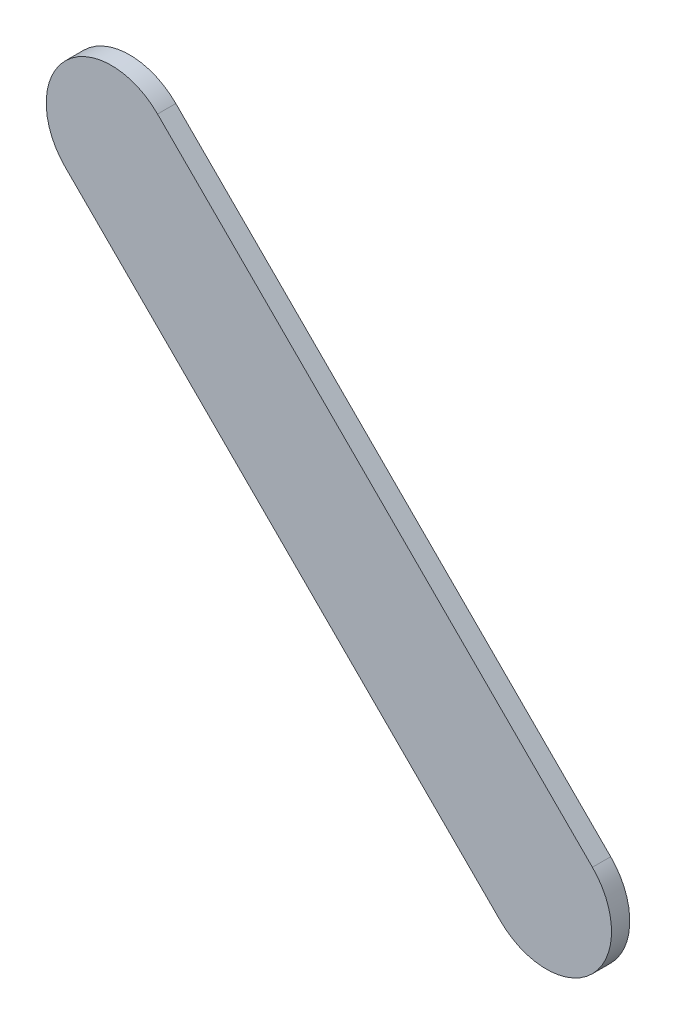
ISO-10303-21;
HEADER;
FILE_DESCRIPTION(('STEP AP214'),'2;1');
FILE_NAME('part.step','',(''),(''),'','','');
FILE_SCHEMA(('AUTOMOTIVE_DESIGN { 1 0 10303 214 1 1 1 1 }'));
ENDSEC;
DATA;
#1=APPLICATION_CONTEXT('core data for automotive mechanical design processes');
#2=APPLICATION_PROTOCOL_DEFINITION('international standard','automotive_design',2000,#1);
#3=PRODUCT_CONTEXT('',#1,'mechanical');
#4=PRODUCT('Part','Part','',(#3));
#5=PRODUCT_RELATED_PRODUCT_CATEGORY('part','',(#4));
#6=PRODUCT_DEFINITION_FORMATION('','',#4);
#7=PRODUCT_DEFINITION_CONTEXT('part definition',#1,'design');
#8=PRODUCT_DEFINITION('design','',#6,#7);
#9=PRODUCT_DEFINITION_SHAPE('','',#8);
#10=(LENGTH_UNIT() NAMED_UNIT(*) SI_UNIT(.MILLI.,.METRE.));
#11=(NAMED_UNIT(*) PLANE_ANGLE_UNIT() SI_UNIT($,.RADIAN.));
#12=(NAMED_UNIT(*) SI_UNIT($,.STERADIAN.) SOLID_ANGLE_UNIT());
#13=UNCERTAINTY_MEASURE_WITH_UNIT(LENGTH_MEASURE(1.E-05),#10,'distance_accuracy_value','');
#14=(GEOMETRIC_REPRESENTATION_CONTEXT(3) GLOBAL_UNCERTAINTY_ASSIGNED_CONTEXT((#13)) GLOBAL_UNIT_ASSIGNED_CONTEXT((#10,
#11,#12)) REPRESENTATION_CONTEXT('',''));
#15=CARTESIAN_POINT('',(0.,0.,0.));
#16=DIRECTION('',(0.,0.,1.));
#17=DIRECTION('',(1.,0.,0.));
#18=AXIS2_PLACEMENT_3D('',#15,#16,#17);
#19=CARTESIAN_POINT('',(86.580218,94.04412484,0.));
#20=DIRECTION('',(0.707106781186542,0.707106781186554,0.));
#21=DIRECTION('',(0.707106781186554,-0.707106781186542,0.));
#22=AXIS2_PLACEMENT_3D('',#19,#20,#21);
#23=PLANE('',#22);
#24=DIRECTION('',(0.707106781186554,-0.707106781186542,0.));
#25=VECTOR('',#24,1.);
#26=CARTESIAN_POINT('',(86.580218,94.04412484,0.03556));
#27=LINE('',#26,#25);
#28=CARTESIAN_POINT('',(86.580218,94.04412484,0.03556));
#29=VERTEX_POINT('',#28);
#30=CARTESIAN_POINT('',(87.42717084,93.197172,0.03556));
#31=VERTEX_POINT('',#30);
#32=EDGE_CURVE('E11',#29,#31,#27,.T.);
#33=ORIENTED_EDGE('',*,*,#32,.F.);
#34=DIRECTION('',(0.,0.,1.));
#35=VECTOR('',#34,1.);
#36=CARTESIAN_POINT('',(86.580218,94.04412484,0.));
#37=LINE('',#36,#35);
#38=CARTESIAN_POINT('',(86.580218,94.04412484,0.));
#39=VERTEX_POINT('',#38);
#40=EDGE_CURVE('E24',#39,#29,#37,.T.);
#41=ORIENTED_EDGE('',*,*,#40,.F.);
#42=DIRECTION('',(0.707106781186554,-0.707106781186542,0.));
#43=VECTOR('',#42,1.);
#44=CARTESIAN_POINT('',(86.580218,94.04412484,0.));
#45=LINE('',#44,#43);
#46=CARTESIAN_POINT('',(87.42717084,93.197172,0.));
#47=VERTEX_POINT('',#46);
#48=EDGE_CURVE('E75',#39,#47,#45,.T.);
#49=ORIENTED_EDGE('',*,*,#48,.T.);
#50=DIRECTION('',(0.,0.,1.));
#51=VECTOR('',#50,1.);
#52=CARTESIAN_POINT('',(87.42717084,93.197172,0.));
#53=LINE('',#52,#51);
#54=EDGE_CURVE('E37',#47,#31,#53,.T.);
#55=ORIENTED_EDGE('',*,*,#54,.T.);
#56=EDGE_LOOP('',(#33,#41,#49,#55));
#57=FACE_BOUND('',#56,.T.);
#58=ADVANCED_FACE('F17',(#57),#23,.F.);
#59=CARTESIAN_POINT('',(87.51697254,93.2869737,0.));
#60=DIRECTION('',(0.,0.,-1.));
#61=DIRECTION('',(-0.707106781186492,-0.707106781186604,0.));
#62=AXIS2_PLACEMENT_3D('',#59,#60,#61);
#63=CYLINDRICAL_SURFACE('',#62,0.12699878206416);
#64=CARTESIAN_POINT('',(87.51697254,93.2869737,0.03556));
#65=DIRECTION('',(0.,0.,1.));
#66=DIRECTION('',(-0.707106781186492,-0.707106781186604,0.));
#67=AXIS2_PLACEMENT_3D('',#64,#65,#66);
#68=CIRCLE('',#67,0.12699878206416);
#69=CARTESIAN_POINT('',(87.60677424,93.3767754,0.03556));
#70=VERTEX_POINT('',#69);
#71=EDGE_CURVE('E83',#31,#70,#68,.T.);
#72=ORIENTED_EDGE('',*,*,#71,.F.);
#73=ORIENTED_EDGE('',*,*,#54,.F.);
#74=CARTESIAN_POINT('',(87.51697254,93.2869737,0.));
#75=DIRECTION('',(0.,0.,1.));
#76=DIRECTION('',(-0.707106781186492,-0.707106781186604,0.));
#77=AXIS2_PLACEMENT_3D('',#74,#75,#76);
#78=CIRCLE('',#77,0.12699878206416);
#79=CARTESIAN_POINT('',(87.60677424,93.3767754,0.));
#80=VERTEX_POINT('',#79);
#81=EDGE_CURVE('E81',#47,#80,#78,.T.);
#82=ORIENTED_EDGE('',*,*,#81,.T.);
#83=DIRECTION('',(0.,0.,1.));
#84=VECTOR('',#83,1.);
#85=CARTESIAN_POINT('',(87.60677424,93.3767754,0.));
#86=LINE('',#85,#84);
#87=EDGE_CURVE('E67',#80,#70,#86,.T.);
#88=ORIENTED_EDGE('',*,*,#87,.T.);
#89=EDGE_LOOP('',(#72,#73,#82,#88));
#90=FACE_BOUND('',#89,.T.);
#91=ADVANCED_FACE('F89',(#90),#63,.T.);
#92=CARTESIAN_POINT('',(87.60677424,93.3767754,0.));
#93=DIRECTION('',(-0.707106781186542,-0.707106781186554,0.));
#94=DIRECTION('',(-0.707106781186554,0.707106781186542,0.));
#95=AXIS2_PLACEMENT_3D('',#92,#93,#94);
#96=PLANE('',#95);
#97=DIRECTION('',(-0.707106781186554,0.707106781186542,0.));
#98=VECTOR('',#97,1.);
#99=CARTESIAN_POINT('',(87.60677424,93.3767754,0.03556));
#100=LINE('',#99,#98);
#101=CARTESIAN_POINT('',(86.7598214,94.22372824,0.03556));
#102=VERTEX_POINT('',#101);
#103=EDGE_CURVE('E71',#70,#102,#100,.T.);
#104=ORIENTED_EDGE('',*,*,#103,.F.);
#105=ORIENTED_EDGE('',*,*,#87,.F.);
#106=DIRECTION('',(-0.707106781186554,0.707106781186542,0.));
#107=VECTOR('',#106,1.);
#108=CARTESIAN_POINT('',(87.60677424,93.3767754,0.));
#109=LINE('',#108,#107);
#110=CARTESIAN_POINT('',(86.7598214,94.22372824,0.));
#111=VERTEX_POINT('',#110);
#112=EDGE_CURVE('E63',#80,#111,#109,.T.);
#113=ORIENTED_EDGE('',*,*,#112,.T.);
#114=DIRECTION('',(0.,0.,1.));
#115=VECTOR('',#114,1.);
#116=CARTESIAN_POINT('',(86.7598214,94.22372824,0.));
#117=LINE('',#116,#115);
#118=EDGE_CURVE('E53',#111,#102,#117,.T.);
#119=ORIENTED_EDGE('',*,*,#118,.T.);
#120=EDGE_LOOP('',(#104,#105,#113,#119));
#121=FACE_BOUND('',#120,.T.);
#122=ADVANCED_FACE('F66',(#121),#96,.F.);
#123=CARTESIAN_POINT('',(86.6700197,94.13392654,0.));
#124=DIRECTION('',(0.,0.,-1.));
#125=DIRECTION('',(0.707106781186604,0.707106781186492,0.));
#126=AXIS2_PLACEMENT_3D('',#123,#124,#125);
#127=CYLINDRICAL_SURFACE('',#126,0.126998782064157);
#128=CARTESIAN_POINT('',(86.6700197,94.13392654,0.03556));
#129=DIRECTION('',(0.,0.,1.));
#130=DIRECTION('',(0.707106781186604,0.707106781186492,0.));
#131=AXIS2_PLACEMENT_3D('',#128,#129,#130);
#132=CIRCLE('',#131,0.126998782064157);
#133=EDGE_CURVE('E59',#102,#29,#132,.T.);
#134=ORIENTED_EDGE('',*,*,#133,.F.);
#135=ORIENTED_EDGE('',*,*,#118,.F.);
#136=CARTESIAN_POINT('',(86.6700197,94.13392654,0.));
#137=DIRECTION('',(0.,0.,1.));
#138=DIRECTION('',(0.707106781186604,0.707106781186492,0.));
#139=AXIS2_PLACEMENT_3D('',#136,#137,#138);
#140=CIRCLE('',#139,0.126998782064157);
#141=EDGE_CURVE('E57',#111,#39,#140,.T.);
#142=ORIENTED_EDGE('',*,*,#141,.T.);
#143=ORIENTED_EDGE('',*,*,#40,.T.);
#144=EDGE_LOOP('',(#134,#135,#142,#143));
#145=FACE_BOUND('',#144,.T.);
#146=ADVANCED_FACE('F55',(#145),#127,.T.);
#147=CARTESIAN_POINT('',(86.580218,94.04412484,0.));
#148=DIRECTION('',(0.,0.,-1.));
#149=DIRECTION('',(-1.,0.,0.));
#150=AXIS2_PLACEMENT_3D('',#147,#148,#149);
#151=PLANE('',#150);
#152=ORIENTED_EDGE('',*,*,#141,.F.);
#153=ORIENTED_EDGE('',*,*,#112,.F.);
#154=ORIENTED_EDGE('',*,*,#81,.F.);
#155=ORIENTED_EDGE('',*,*,#48,.F.);
#156=EDGE_LOOP('',(#152,#153,#154,#155));
#157=FACE_BOUND('',#156,.T.);
#158=ADVANCED_FACE('F74',(#157),#151,.T.);
#159=CARTESIAN_POINT('',(86.580218,94.04412484,0.03556));
#160=DIRECTION('',(0.,0.,-1.));
#161=DIRECTION('',(-1.,0.,0.));
#162=AXIS2_PLACEMENT_3D('',#159,#160,#161);
#163=PLANE('',#162);
#164=ORIENTED_EDGE('',*,*,#32,.T.);
#165=ORIENTED_EDGE('',*,*,#71,.T.);
#166=ORIENTED_EDGE('',*,*,#103,.T.);
#167=ORIENTED_EDGE('',*,*,#133,.T.);
#168=EDGE_LOOP('',(#164,#165,#166,#167));
#169=FACE_BOUND('',#168,.T.);
#170=ADVANCED_FACE('F91',(#169),#163,.F.);
#171=CLOSED_SHELL('',(#58,#91,#122,#146,#158,#170));
#172=MANIFOLD_SOLID_BREP('B1',#171);
#173=ADVANCED_BREP_SHAPE_REPRESENTATION('',(#18,#172),#14);
#174=SHAPE_DEFINITION_REPRESENTATION(#9,#173);
ENDSEC;
END-ISO-10303-21;
